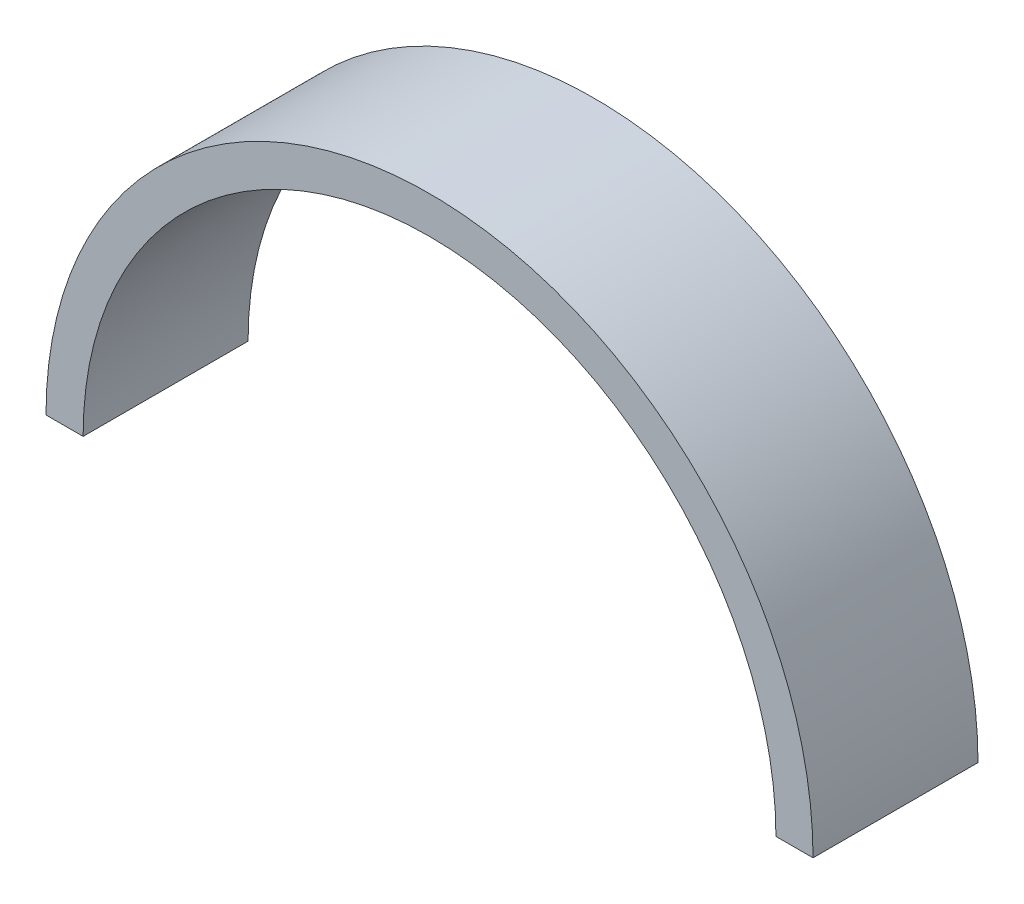
ISO-10303-21;
HEADER;
FILE_DESCRIPTION(('STEP AP214'),'2;1');
FILE_NAME('part.step','',(''),(''),'','','');
FILE_SCHEMA(('AUTOMOTIVE_DESIGN { 1 0 10303 214 1 1 1 1 }'));
ENDSEC;
DATA;
#1=APPLICATION_CONTEXT('core data for automotive mechanical design processes');
#2=APPLICATION_PROTOCOL_DEFINITION('international standard','automotive_design',2000,#1);
#3=PRODUCT_CONTEXT('',#1,'mechanical');
#4=PRODUCT('Part','Part','',(#3));
#5=PRODUCT_RELATED_PRODUCT_CATEGORY('part','',(#4));
#6=PRODUCT_DEFINITION_FORMATION('','',#4);
#7=PRODUCT_DEFINITION_CONTEXT('part definition',#1,'design');
#8=PRODUCT_DEFINITION('design','',#6,#7);
#9=PRODUCT_DEFINITION_SHAPE('','',#8);
#10=(LENGTH_UNIT() NAMED_UNIT(*) SI_UNIT(.MILLI.,.METRE.));
#11=(NAMED_UNIT(*) PLANE_ANGLE_UNIT() SI_UNIT($,.RADIAN.));
#12=(NAMED_UNIT(*) SI_UNIT($,.STERADIAN.) SOLID_ANGLE_UNIT());
#13=UNCERTAINTY_MEASURE_WITH_UNIT(LENGTH_MEASURE(1.E-05),#10,'distance_accuracy_value','');
#14=(GEOMETRIC_REPRESENTATION_CONTEXT(3) GLOBAL_UNCERTAINTY_ASSIGNED_CONTEXT((#13)) GLOBAL_UNIT_ASSIGNED_CONTEXT((#10,
#11,#12)) REPRESENTATION_CONTEXT('',''));
#15=CARTESIAN_POINT('',(0.,0.,0.));
#16=DIRECTION('',(0.,0.,1.));
#17=DIRECTION('',(1.,0.,0.));
#18=AXIS2_PLACEMENT_3D('',#15,#16,#17);
#19=CARTESIAN_POINT('',(0.,0.,20.));
#20=DIRECTION('',(0.,0.,-1.));
#21=DIRECTION('',(-1.,0.,0.));
#22=AXIS2_PLACEMENT_3D('',#19,#20,#21);
#23=CYLINDRICAL_SURFACE('',#22,46.5);
#24=CARTESIAN_POINT('',(0.,0.,0.));
#25=DIRECTION('',(0.,0.,1.));
#26=DIRECTION('',(-1.,0.,0.));
#27=AXIS2_PLACEMENT_3D('',#24,#25,#26);
#28=CIRCLE('',#27,46.5);
#29=CARTESIAN_POINT('',(46.5,0.,0.));
#30=VERTEX_POINT('',#29);
#31=CARTESIAN_POINT('',(-46.5,0.,0.));
#32=VERTEX_POINT('',#31);
#33=EDGE_CURVE('E97',#30,#32,#28,.T.);
#34=ORIENTED_EDGE('',*,*,#33,.T.);
#35=DIRECTION('',(0.,0.,-1.));
#36=VECTOR('',#35,1.);
#37=CARTESIAN_POINT('',(-46.5,0.,20.));
#38=LINE('',#37,#36);
#39=CARTESIAN_POINT('',(-46.5,0.,20.));
#40=VERTEX_POINT('',#39);
#41=EDGE_CURVE('E11',#40,#32,#38,.T.);
#42=ORIENTED_EDGE('',*,*,#41,.F.);
#43=CARTESIAN_POINT('',(0.,0.,20.));
#44=DIRECTION('',(0.,0.,1.));
#45=DIRECTION('',(-1.,0.,0.));
#46=AXIS2_PLACEMENT_3D('',#43,#44,#45);
#47=CIRCLE('',#46,46.5);
#48=CARTESIAN_POINT('',(46.5,0.,20.));
#49=VERTEX_POINT('',#48);
#50=EDGE_CURVE('E85',#49,#40,#47,.T.);
#51=ORIENTED_EDGE('',*,*,#50,.F.);
#52=DIRECTION('',(0.,0.,-1.));
#53=VECTOR('',#52,1.);
#54=CARTESIAN_POINT('',(46.5,0.,20.));
#55=LINE('',#54,#53);
#56=EDGE_CURVE('E93',#49,#30,#55,.T.);
#57=ORIENTED_EDGE('',*,*,#56,.T.);
#58=EDGE_LOOP('',(#34,#42,#51,#57));
#59=FACE_BOUND('',#58,.T.);
#60=ADVANCED_FACE('F34',(#59),#23,.T.);
#61=CARTESIAN_POINT('',(-46.5,0.,20.));
#62=DIRECTION('',(0.,1.,0.));
#63=DIRECTION('',(0.,0.,1.));
#64=AXIS2_PLACEMENT_3D('',#61,#62,#63);
#65=PLANE('',#64);
#66=DIRECTION('',(1.,0.,0.));
#67=VECTOR('',#66,1.);
#68=CARTESIAN_POINT('',(-46.5,0.,0.));
#69=LINE('',#68,#67);
#70=CARTESIAN_POINT('',(-42.,0.,0.));
#71=VERTEX_POINT('',#70);
#72=EDGE_CURVE('E89',#32,#71,#69,.T.);
#73=ORIENTED_EDGE('',*,*,#72,.T.);
#74=DIRECTION('',(0.,0.,-1.));
#75=VECTOR('',#74,1.);
#76=CARTESIAN_POINT('',(-42.,0.,20.));
#77=LINE('',#76,#75);
#78=CARTESIAN_POINT('',(-42.,0.,20.));
#79=VERTEX_POINT('',#78);
#80=EDGE_CURVE('E42',#79,#71,#77,.T.);
#81=ORIENTED_EDGE('',*,*,#80,.F.);
#82=DIRECTION('',(1.,0.,0.));
#83=VECTOR('',#82,1.);
#84=CARTESIAN_POINT('',(-46.5,0.,20.));
#85=LINE('',#84,#83);
#86=EDGE_CURVE('E80',#40,#79,#85,.T.);
#87=ORIENTED_EDGE('',*,*,#86,.F.);
#88=ORIENTED_EDGE('',*,*,#41,.T.);
#89=EDGE_LOOP('',(#73,#81,#87,#88));
#90=FACE_BOUND('',#89,.T.);
#91=ADVANCED_FACE('F88',(#90),#65,.F.);
#92=CARTESIAN_POINT('',(0.,0.,20.));
#93=DIRECTION('',(0.,0.,-1.));
#94=DIRECTION('',(-1.,0.,0.));
#95=AXIS2_PLACEMENT_3D('',#92,#93,#94);
#96=CYLINDRICAL_SURFACE('',#95,42.);
#97=CARTESIAN_POINT('',(0.,0.,0.));
#98=DIRECTION('',(0.,0.,-1.));
#99=DIRECTION('',(-1.,0.,0.));
#100=AXIS2_PLACEMENT_3D('',#97,#98,#99);
#101=CIRCLE('',#100,42.);
#102=CARTESIAN_POINT('',(42.,0.,0.));
#103=VERTEX_POINT('',#102);
#104=EDGE_CURVE('E67',#71,#103,#101,.T.);
#105=ORIENTED_EDGE('',*,*,#104,.T.);
#106=DIRECTION('',(0.,0.,-1.));
#107=VECTOR('',#106,1.);
#108=CARTESIAN_POINT('',(42.,0.,20.));
#109=LINE('',#108,#107);
#110=CARTESIAN_POINT('',(42.,0.,20.));
#111=VERTEX_POINT('',#110);
#112=EDGE_CURVE('E90',#111,#103,#109,.T.);
#113=ORIENTED_EDGE('',*,*,#112,.F.);
#114=CARTESIAN_POINT('',(0.,0.,20.));
#115=DIRECTION('',(0.,0.,-1.));
#116=DIRECTION('',(-1.,0.,0.));
#117=AXIS2_PLACEMENT_3D('',#114,#115,#116);
#118=CIRCLE('',#117,42.);
#119=EDGE_CURVE('E83',#79,#111,#118,.T.);
#120=ORIENTED_EDGE('',*,*,#119,.F.);
#121=ORIENTED_EDGE('',*,*,#80,.T.);
#122=EDGE_LOOP('',(#105,#113,#120,#121));
#123=FACE_BOUND('',#122,.T.);
#124=ADVANCED_FACE('F91',(#123),#96,.F.);
#125=CARTESIAN_POINT('',(42.,0.,20.));
#126=DIRECTION('',(0.,1.,0.));
#127=DIRECTION('',(0.,0.,1.));
#128=AXIS2_PLACEMENT_3D('',#125,#126,#127);
#129=PLANE('',#128);
#130=DIRECTION('',(1.,0.,0.));
#131=VECTOR('',#130,1.);
#132=CARTESIAN_POINT('',(42.,0.,0.));
#133=LINE('',#132,#131);
#134=EDGE_CURVE('E73',#103,#30,#133,.T.);
#135=ORIENTED_EDGE('',*,*,#134,.T.);
#136=ORIENTED_EDGE('',*,*,#56,.F.);
#137=DIRECTION('',(1.,0.,0.));
#138=VECTOR('',#137,1.);
#139=CARTESIAN_POINT('',(42.,0.,20.));
#140=LINE('',#139,#138);
#141=EDGE_CURVE('E50',#111,#49,#140,.T.);
#142=ORIENTED_EDGE('',*,*,#141,.F.);
#143=ORIENTED_EDGE('',*,*,#112,.T.);
#144=EDGE_LOOP('',(#135,#136,#142,#143));
#145=FACE_BOUND('',#144,.T.);
#146=ADVANCED_FACE('F104',(#145),#129,.F.);
#147=CARTESIAN_POINT('',(0.,0.,20.));
#148=DIRECTION('',(0.,0.,-1.));
#149=DIRECTION('',(-1.,0.,0.));
#150=AXIS2_PLACEMENT_3D('',#147,#148,#149);
#151=PLANE('',#150);
#152=ORIENTED_EDGE('',*,*,#50,.T.);
#153=ORIENTED_EDGE('',*,*,#86,.T.);
#154=ORIENTED_EDGE('',*,*,#119,.T.);
#155=ORIENTED_EDGE('',*,*,#141,.T.);
#156=EDGE_LOOP('',(#152,#153,#154,#155));
#157=FACE_BOUND('',#156,.T.);
#158=ADVANCED_FACE('F81',(#157),#151,.F.);
#159=CARTESIAN_POINT('',(0.,0.,0.));
#160=DIRECTION('',(0.,0.,-1.));
#161=DIRECTION('',(-1.,0.,0.));
#162=AXIS2_PLACEMENT_3D('',#159,#160,#161);
#163=PLANE('',#162);
#164=ORIENTED_EDGE('',*,*,#33,.F.);
#165=ORIENTED_EDGE('',*,*,#134,.F.);
#166=ORIENTED_EDGE('',*,*,#104,.F.);
#167=ORIENTED_EDGE('',*,*,#72,.F.);
#168=EDGE_LOOP('',(#164,#165,#166,#167));
#169=FACE_BOUND('',#168,.T.);
#170=ADVANCED_FACE('F107',(#169),#163,.T.);
#171=CLOSED_SHELL('',(#60,#91,#124,#146,#158,#170));
#172=MANIFOLD_SOLID_BREP('B2',#171);
#173=ADVANCED_BREP_SHAPE_REPRESENTATION('',(#18,#172),#14);
#174=SHAPE_DEFINITION_REPRESENTATION(#9,#173);
ENDSEC;
END-ISO-10303-21;
